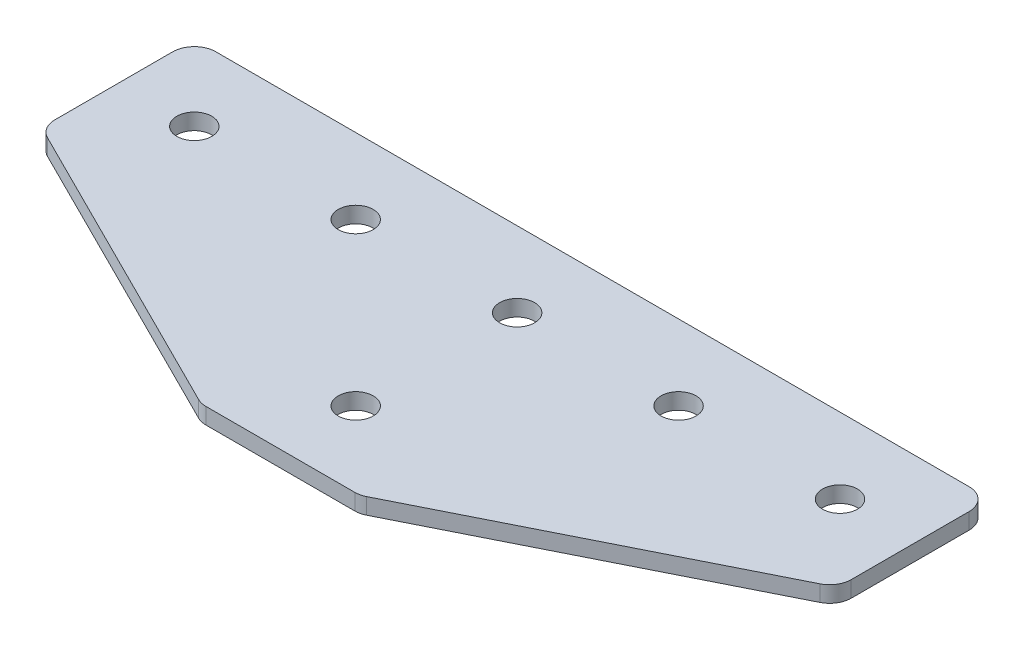
ISO-10303-21;
HEADER;
FILE_DESCRIPTION(('STEP AP214'),'2;1');
FILE_NAME('part.step','',(''),(''),'','','');
FILE_SCHEMA(('AUTOMOTIVE_DESIGN { 1 0 10303 214 1 1 1 1 }'));
ENDSEC;
DATA;
#1=APPLICATION_CONTEXT('core data for automotive mechanical design processes');
#2=APPLICATION_PROTOCOL_DEFINITION('international standard','automotive_design',2000,#1);
#3=PRODUCT_CONTEXT('',#1,'mechanical');
#4=PRODUCT('Part','Part','',(#3));
#5=PRODUCT_RELATED_PRODUCT_CATEGORY('part','',(#4));
#6=PRODUCT_DEFINITION_FORMATION('','',#4);
#7=PRODUCT_DEFINITION_CONTEXT('part definition',#1,'design');
#8=PRODUCT_DEFINITION('design','',#6,#7);
#9=PRODUCT_DEFINITION_SHAPE('','',#8);
#10=(LENGTH_UNIT() NAMED_UNIT(*) SI_UNIT(.MILLI.,.METRE.));
#11=(NAMED_UNIT(*) PLANE_ANGLE_UNIT() SI_UNIT($,.RADIAN.));
#12=(NAMED_UNIT(*) SI_UNIT($,.STERADIAN.) SOLID_ANGLE_UNIT());
#13=UNCERTAINTY_MEASURE_WITH_UNIT(LENGTH_MEASURE(1.E-05),#10,'distance_accuracy_value','');
#14=(GEOMETRIC_REPRESENTATION_CONTEXT(3) GLOBAL_UNCERTAINTY_ASSIGNED_CONTEXT((#13)) GLOBAL_UNIT_ASSIGNED_CONTEXT((#10,
#11,#12)) REPRESENTATION_CONTEXT('',''));
#15=CARTESIAN_POINT('',(0.,0.,0.));
#16=DIRECTION('',(0.,0.,1.));
#17=DIRECTION('',(1.,0.,0.));
#18=AXIS2_PLACEMENT_3D('',#15,#16,#17);
#19=CARTESIAN_POINT('',(-0.890698618547958,1.95798729366106,-9.31684858716831));
#20=DIRECTION('',(0.,-1.,0.));
#21=DIRECTION('',(0.,0.,-1.));
#22=AXIS2_PLACEMENT_3D('',#19,#20,#21);
#23=PLANE('',#22);
#24=CARTESIAN_POINT('',(-0.890698618547958,1.95798729366106,-9.31684858716831));
#25=DIRECTION('',(0.,1.,0.));
#26=DIRECTION('',(0.,0.,1.));
#27=AXIS2_PLACEMENT_3D('',#24,#25,#26);
#28=CIRCLE('',#27,1.625);
#29=CARTESIAN_POINT('',(-0.890698618547958,1.95798729366106,-7.69184858716831));
#30=VERTEX_POINT('',#29);
#31=EDGE_CURVE('E159',#30,#30,#28,.T.);
#32=ORIENTED_EDGE('',*,*,#31,.T.);
#33=EDGE_LOOP('',(#32));
#34=FACE_BOUND('',#33,.T.);
#35=DIRECTION('',(1.,0.,0.));
#36=VECTOR('',#35,1.);
#37=CARTESIAN_POINT('',(-7.89069861854805,1.95798729366106,12.6831514128317));
#38=LINE('',#37,#36);
#39=CARTESIAN_POINT('',(-7.80052867479859,1.95798729366106,12.6831514128317));
#40=VERTEX_POINT('',#39);
#41=CARTESIAN_POINT('',(6.01913143770267,1.95798729366106,12.6831514128317));
#42=VERTEX_POINT('',#41);
#43=EDGE_CURVE('E168',#40,#42,#38,.T.);
#44=ORIENTED_EDGE('',*,*,#43,.F.);
#45=CARTESIAN_POINT('',(-7.80052867479859,1.95798729366106,10.6831514128316));
#46=DIRECTION('',(0.,-1.,0.));
#47=DIRECTION('',(0.,0.,-1.));
#48=AXIS2_PLACEMENT_3D('',#45,#46,#47);
#49=CIRCLE('',#48,2.);
#50=CARTESIAN_POINT('',(-8.6949558657985,1.95798729366106,12.4720057948315));
#51=VERTEX_POINT('',#50);
#52=EDGE_CURVE('E212',#40,#51,#49,.T.);
#53=ORIENTED_EDGE('',*,*,#52,.T.);
#54=DIRECTION('',(-0.894427190999916,0.,-0.447213595499958));
#55=VECTOR('',#54,1.);
#56=CARTESIAN_POINT('',(-8.27266462979816,1.95798729366106,12.6831514128317));
#57=LINE('',#56,#55);
#58=CARTESIAN_POINT('',(-36.7851258095478,1.95798729366106,-1.57307917704317));
#59=VERTEX_POINT('',#58);
#60=EDGE_CURVE('E132',#51,#59,#57,.T.);
#61=ORIENTED_EDGE('',*,*,#60,.T.);
#62=CARTESIAN_POINT('',(-35.8906986185479,1.95798729366106,-3.361933559043));
#63=DIRECTION('',(0.,-1.,0.));
#64=DIRECTION('',(0.,0.,-1.));
#65=AXIS2_PLACEMENT_3D('',#62,#63,#64);
#66=CIRCLE('',#65,2.);
#67=CARTESIAN_POINT('',(-37.8906986185479,1.95798729366106,-3.361933559043));
#68=VERTEX_POINT('',#67);
#69=EDGE_CURVE('E186',#59,#68,#66,.T.);
#70=ORIENTED_EDGE('',*,*,#69,.T.);
#71=DIRECTION('',(0.,0.,-1.));
#72=VECTOR('',#71,1.);
#73=CARTESIAN_POINT('',(-37.8906986185479,1.95798729366106,-2.12586558154321));
#74=LINE('',#73,#72);
#75=CARTESIAN_POINT('',(-37.8906986185479,1.95798729366106,-14.3168485871683));
#76=VERTEX_POINT('',#75);
#77=EDGE_CURVE('E125',#68,#76,#74,.T.);
#78=ORIENTED_EDGE('',*,*,#77,.T.);
#79=CARTESIAN_POINT('',(-35.8906986185479,1.95798729366106,-14.3168485871683));
#80=DIRECTION('',(0.,-1.,0.));
#81=DIRECTION('',(0.,0.,-1.));
#82=AXIS2_PLACEMENT_3D('',#79,#80,#81);
#83=CIRCLE('',#82,2.);
#84=CARTESIAN_POINT('',(-35.8906986185479,1.95798729366106,-16.3168485871683));
#85=VERTEX_POINT('',#84);
#86=EDGE_CURVE('E205',#76,#85,#83,.T.);
#87=ORIENTED_EDGE('',*,*,#86,.T.);
#88=DIRECTION('',(-1.,0.,0.));
#89=VECTOR('',#88,1.);
#90=CARTESIAN_POINT('',(36.1093013814519,1.95798729366106,-16.3168485871684));
#91=LINE('',#90,#89);
#92=CARTESIAN_POINT('',(34.1093013814519,1.95798729366106,-16.3168485871684));
#93=VERTEX_POINT('',#92);
#94=EDGE_CURVE('E165',#93,#85,#91,.T.);
#95=ORIENTED_EDGE('',*,*,#94,.F.);
#96=CARTESIAN_POINT('',(34.1093013814519,1.95798729366106,-14.3168485871684));
#97=DIRECTION('',(0.,-1.,0.));
#98=DIRECTION('',(0.,0.,-1.));
#99=AXIS2_PLACEMENT_3D('',#96,#97,#98);
#100=CIRCLE('',#99,2.);
#101=CARTESIAN_POINT('',(36.1093013814519,1.95798729366106,-14.3168485871684));
#102=VERTEX_POINT('',#101);
#103=EDGE_CURVE('E207',#93,#102,#100,.T.);
#104=ORIENTED_EDGE('',*,*,#103,.T.);
#105=DIRECTION('',(0.,0.,-1.));
#106=VECTOR('',#105,1.);
#107=CARTESIAN_POINT('',(36.1093013814519,1.95798729366106,-2.12586558154322));
#108=LINE('',#107,#106);
#109=CARTESIAN_POINT('',(36.1093013814519,1.95798729366106,-3.361933559043));
#110=VERTEX_POINT('',#109);
#111=EDGE_CURVE('E126',#110,#102,#108,.T.);
#112=ORIENTED_EDGE('',*,*,#111,.F.);
#113=CARTESIAN_POINT('',(34.1093013814519,1.95798729366106,-3.36193355904301));
#114=DIRECTION('',(0.,-1.,0.));
#115=DIRECTION('',(0.,0.,-1.));
#116=AXIS2_PLACEMENT_3D('',#113,#114,#115);
#117=CIRCLE('',#116,2.);
#118=CARTESIAN_POINT('',(35.0037285724519,1.95798729366106,-1.57307917704318));
#119=VERTEX_POINT('',#118);
#120=EDGE_CURVE('E31',#110,#119,#117,.T.);
#121=ORIENTED_EDGE('',*,*,#120,.T.);
#122=DIRECTION('',(0.894427190999916,0.,-0.447213595499959));
#123=VECTOR('',#122,1.);
#124=CARTESIAN_POINT('',(6.49126739270224,1.95798729366106,12.6831514128317));
#125=LINE('',#124,#123);
#126=CARTESIAN_POINT('',(6.91355862870259,1.95798729366106,12.4720057948315));
#127=VERTEX_POINT('',#126);
#128=EDGE_CURVE('E172',#127,#119,#125,.T.);
#129=ORIENTED_EDGE('',*,*,#128,.F.);
#130=CARTESIAN_POINT('',(6.01913143770267,1.95798729366106,10.6831514128316));
#131=DIRECTION('',(0.,-1.,0.));
#132=DIRECTION('',(0.,0.,-1.));
#133=AXIS2_PLACEMENT_3D('',#130,#131,#132);
#134=CIRCLE('',#133,2.);
#135=EDGE_CURVE('E210',#127,#42,#134,.T.);
#136=ORIENTED_EDGE('',*,*,#135,.T.);
#137=EDGE_LOOP('',(#44,#53,#61,#70,#78,#87,#95,#104,#112,#121,#129,#136));
#138=FACE_BOUND('',#137,.T.);
#139=CARTESIAN_POINT('',(-0.890698618547969,1.95798729366106,5.68315141283169));
#140=DIRECTION('',(0.,1.,0.));
#141=DIRECTION('',(0.,0.,1.));
#142=AXIS2_PLACEMENT_3D('',#139,#140,#141);
#143=CIRCLE('',#142,1.625);
#144=CARTESIAN_POINT('',(-0.890698618547969,1.95798729366106,7.30815141283169));
#145=VERTEX_POINT('',#144);
#146=EDGE_CURVE('E147',#145,#145,#143,.T.);
#147=ORIENTED_EDGE('',*,*,#146,.T.);
#148=EDGE_LOOP('',(#147));
#149=FACE_BOUND('',#148,.T.);
#150=CARTESIAN_POINT('',(29.109301381452,1.95798729366106,-9.31684858716831));
#151=DIRECTION('',(0.,1.,0.));
#152=DIRECTION('',(0.,0.,1.));
#153=AXIS2_PLACEMENT_3D('',#150,#151,#152);
#154=CIRCLE('',#153,1.625);
#155=CARTESIAN_POINT('',(29.109301381452,1.95798729366106,-7.69184858716831));
#156=VERTEX_POINT('',#155);
#157=EDGE_CURVE('E140',#156,#156,#154,.T.);
#158=ORIENTED_EDGE('',*,*,#157,.T.);
#159=EDGE_LOOP('',(#158));
#160=FACE_BOUND('',#159,.T.);
#161=CARTESIAN_POINT('',(14.109301381452,1.95798729366106,-9.3168485871683));
#162=DIRECTION('',(0.,1.,0.));
#163=DIRECTION('',(0.,0.,1.));
#164=AXIS2_PLACEMENT_3D('',#161,#162,#163);
#165=CIRCLE('',#164,1.625);
#166=CARTESIAN_POINT('',(14.109301381452,1.95798729366106,-7.6918485871683));
#167=VERTEX_POINT('',#166);
#168=EDGE_CURVE('E153',#167,#167,#165,.T.);
#169=ORIENTED_EDGE('',*,*,#168,.T.);
#170=EDGE_LOOP('',(#169));
#171=FACE_BOUND('',#170,.T.);
#172=CARTESIAN_POINT('',(-30.890698618548,1.95798729366106,-9.31684858716831));
#173=DIRECTION('',(0.,-1.,0.));
#174=DIRECTION('',(0.,0.,1.));
#175=AXIS2_PLACEMENT_3D('',#172,#173,#174);
#176=CIRCLE('',#175,1.625);
#177=CARTESIAN_POINT('',(-30.890698618548,1.95798729366106,-7.69184858716831));
#178=VERTEX_POINT('',#177);
#179=EDGE_CURVE('E460',#178,#178,#176,.T.);
#180=ORIENTED_EDGE('',*,*,#179,.F.);
#181=EDGE_LOOP('',(#180));
#182=FACE_BOUND('',#181,.T.);
#183=CARTESIAN_POINT('',(-15.890698618548,1.95798729366106,-9.3168485871683));
#184=DIRECTION('',(0.,-1.,0.));
#185=DIRECTION('',(0.,0.,1.));
#186=AXIS2_PLACEMENT_3D('',#183,#184,#185);
#187=CIRCLE('',#186,1.625);
#188=CARTESIAN_POINT('',(-15.890698618548,1.95798729366106,-7.6918485871683));
#189=VERTEX_POINT('',#188);
#190=EDGE_CURVE('E136',#189,#189,#187,.T.);
#191=ORIENTED_EDGE('',*,*,#190,.F.);
#192=EDGE_LOOP('',(#191));
#193=FACE_BOUND('',#192,.T.);
#194=ADVANCED_FACE('F16',(#34,#138,#149,#160,#171,#182,#193),#23,.T.);
#195=CARTESIAN_POINT('',(36.1093013814519,1.95798729366106,-16.3168485871684));
#196=DIRECTION('',(0.,0.,-1.));
#197=DIRECTION('',(-1.,0.,0.));
#198=AXIS2_PLACEMENT_3D('',#195,#196,#197);
#199=PLANE('',#198);
#200=DIRECTION('',(-1.,0.,0.));
#201=VECTOR('',#200,1.);
#202=CARTESIAN_POINT('',(36.1093013814519,3.45798729366106,-16.3168485871684));
#203=LINE('',#202,#201);
#204=CARTESIAN_POINT('',(34.1093013814519,3.45798729366106,-16.3168485871684));
#205=VERTEX_POINT('',#204);
#206=CARTESIAN_POINT('',(-35.8906986185479,3.45798729366106,-16.3168485871683));
#207=VERTEX_POINT('',#206);
#208=EDGE_CURVE('E162',#205,#207,#203,.T.);
#209=ORIENTED_EDGE('',*,*,#208,.F.);
#210=DIRECTION('',(0.,1.,0.));
#211=VECTOR('',#210,1.);
#212=CARTESIAN_POINT('',(34.1093013814519,1.95798729366106,-16.3168485871684));
#213=LINE('',#212,#211);
#214=EDGE_CURVE('E24',#205,#93,#213,.F.);
#215=ORIENTED_EDGE('',*,*,#214,.T.);
#216=ORIENTED_EDGE('',*,*,#94,.T.);
#217=DIRECTION('',(0.,1.,0.));
#218=VECTOR('',#217,1.);
#219=CARTESIAN_POINT('',(-35.8906986185479,1.95798729366106,-16.3168485871683));
#220=LINE('',#219,#218);
#221=EDGE_CURVE('E223',#85,#207,#220,.T.);
#222=ORIENTED_EDGE('',*,*,#221,.T.);
#223=EDGE_LOOP('',(#209,#215,#216,#222));
#224=FACE_BOUND('',#223,.T.);
#225=ADVANCED_FACE('F229',(#224),#199,.T.);
#226=CARTESIAN_POINT('',(36.1093013814519,1.95798729366106,-2.12586558154322));
#227=DIRECTION('',(1.,0.,0.));
#228=DIRECTION('',(0.,0.,-1.));
#229=AXIS2_PLACEMENT_3D('',#226,#227,#228);
#230=PLANE('',#229);
#231=DIRECTION('',(0.,0.,-1.));
#232=VECTOR('',#231,1.);
#233=CARTESIAN_POINT('',(36.1093013814519,3.45798729366106,-2.12586558154322));
#234=LINE('',#233,#232);
#235=CARTESIAN_POINT('',(36.1093013814519,3.45798729366106,-3.361933559043));
#236=VERTEX_POINT('',#235);
#237=CARTESIAN_POINT('',(36.1093013814519,3.45798729366106,-14.3168485871684));
#238=VERTEX_POINT('',#237);
#239=EDGE_CURVE('E169',#236,#238,#234,.T.);
#240=ORIENTED_EDGE('',*,*,#239,.F.);
#241=DIRECTION('',(0.,1.,0.));
#242=VECTOR('',#241,1.);
#243=CARTESIAN_POINT('',(36.1093013814519,1.95798729366106,-3.361933559043));
#244=LINE('',#243,#242);
#245=EDGE_CURVE('E221',#236,#110,#244,.F.);
#246=ORIENTED_EDGE('',*,*,#245,.T.);
#247=ORIENTED_EDGE('',*,*,#111,.T.);
#248=DIRECTION('',(0.,1.,0.));
#249=VECTOR('',#248,1.);
#250=CARTESIAN_POINT('',(36.1093013814519,1.95798729366106,-14.3168485871684));
#251=LINE('',#250,#249);
#252=EDGE_CURVE('E218',#102,#238,#251,.T.);
#253=ORIENTED_EDGE('',*,*,#252,.T.);
#254=EDGE_LOOP('',(#240,#246,#247,#253));
#255=FACE_BOUND('',#254,.T.);
#256=ADVANCED_FACE('F240',(#255),#230,.T.);
#257=CARTESIAN_POINT('',(6.49126739270224,1.95798729366106,12.6831514128317));
#258=DIRECTION('',(0.447213595499958,0.,0.894427190999916));
#259=DIRECTION('',(0.894427190999916,0.,-0.447213595499959));
#260=AXIS2_PLACEMENT_3D('',#257,#258,#259);
#261=PLANE('',#260);
#262=DIRECTION('',(0.894427190999916,0.,-0.447213595499959));
#263=VECTOR('',#262,1.);
#264=CARTESIAN_POINT('',(6.49126739270224,3.45798729366106,12.6831514128317));
#265=LINE('',#264,#263);
#266=CARTESIAN_POINT('',(6.91355862870259,3.45798729366106,12.4720057948315));
#267=VERTEX_POINT('',#266);
#268=CARTESIAN_POINT('',(35.0037285724519,3.45798729366106,-1.57307917704318));
#269=VERTEX_POINT('',#268);
#270=EDGE_CURVE('E180',#267,#269,#265,.T.);
#271=ORIENTED_EDGE('',*,*,#270,.F.);
#272=DIRECTION('',(0.,1.,0.));
#273=VECTOR('',#272,1.);
#274=CARTESIAN_POINT('',(6.91355862870259,1.95798729366106,12.4720057948315));
#275=LINE('',#274,#273);
#276=EDGE_CURVE('E38',#267,#127,#275,.F.);
#277=ORIENTED_EDGE('',*,*,#276,.T.);
#278=ORIENTED_EDGE('',*,*,#128,.T.);
#279=DIRECTION('',(0.,1.,0.));
#280=VECTOR('',#279,1.);
#281=CARTESIAN_POINT('',(35.0037285724518,1.95798729366106,-1.57307917704317));
#282=LINE('',#281,#280);
#283=EDGE_CURVE('E214',#119,#269,#282,.T.);
#284=ORIENTED_EDGE('',*,*,#283,.T.);
#285=EDGE_LOOP('',(#271,#277,#278,#284));
#286=FACE_BOUND('',#285,.T.);
#287=ADVANCED_FACE('F245',(#286),#261,.T.);
#288=CARTESIAN_POINT('',(-7.89069861854805,1.95798729366106,12.6831514128317));
#289=DIRECTION('',(0.,0.,1.));
#290=DIRECTION('',(1.,0.,0.));
#291=AXIS2_PLACEMENT_3D('',#288,#289,#290);
#292=PLANE('',#291);
#293=DIRECTION('',(1.,0.,0.));
#294=VECTOR('',#293,1.);
#295=CARTESIAN_POINT('',(-7.89069861854805,3.45798729366106,12.6831514128317));
#296=LINE('',#295,#294);
#297=CARTESIAN_POINT('',(-7.80052867479859,3.45798729366106,12.6831514128317));
#298=VERTEX_POINT('',#297);
#299=CARTESIAN_POINT('',(6.01913143770267,3.45798729366106,12.6831514128317));
#300=VERTEX_POINT('',#299);
#301=EDGE_CURVE('E177',#298,#300,#296,.T.);
#302=ORIENTED_EDGE('',*,*,#301,.F.);
#303=DIRECTION('',(0.,1.,0.));
#304=VECTOR('',#303,1.);
#305=CARTESIAN_POINT('',(-7.80052867479859,1.95798729366106,12.6831514128317));
#306=LINE('',#305,#304);
#307=EDGE_CURVE('E203',#298,#40,#306,.F.);
#308=ORIENTED_EDGE('',*,*,#307,.T.);
#309=ORIENTED_EDGE('',*,*,#43,.T.);
#310=DIRECTION('',(0.,1.,0.));
#311=VECTOR('',#310,1.);
#312=CARTESIAN_POINT('',(6.01913143770267,1.95798729366106,12.6831514128317));
#313=LINE('',#312,#311);
#314=EDGE_CURVE('E200',#42,#300,#313,.T.);
#315=ORIENTED_EDGE('',*,*,#314,.T.);
#316=EDGE_LOOP('',(#302,#308,#309,#315));
#317=FACE_BOUND('',#316,.T.);
#318=ADVANCED_FACE('F252',(#317),#292,.T.);
#319=CARTESIAN_POINT('',(-0.890698618547958,3.45798729366106,-9.31684858716831));
#320=DIRECTION('',(0.,-1.,0.));
#321=DIRECTION('',(0.,0.,-1.));
#322=AXIS2_PLACEMENT_3D('',#319,#320,#321);
#323=PLANE('',#322);
#324=CARTESIAN_POINT('',(-0.890698618547958,3.45798729366106,-9.31684858716831));
#325=DIRECTION('',(0.,1.,0.));
#326=DIRECTION('',(0.,0.,1.));
#327=AXIS2_PLACEMENT_3D('',#324,#325,#326);
#328=CIRCLE('',#327,1.625);
#329=CARTESIAN_POINT('',(-0.890698618547958,3.45798729366106,-7.69184858716831));
#330=VERTEX_POINT('',#329);
#331=EDGE_CURVE('E156',#330,#330,#328,.T.);
#332=ORIENTED_EDGE('',*,*,#331,.F.);
#333=EDGE_LOOP('',(#332));
#334=FACE_BOUND('',#333,.T.);
#335=DIRECTION('',(-0.894427190999916,0.,-0.447213595499958));
#336=VECTOR('',#335,1.);
#337=CARTESIAN_POINT('',(-8.27266462979816,3.45798729366106,12.6831514128317));
#338=LINE('',#337,#336);
#339=CARTESIAN_POINT('',(-8.6949558657985,3.45798729366106,12.4720057948315));
#340=VERTEX_POINT('',#339);
#341=CARTESIAN_POINT('',(-36.7851258095478,3.45798729366106,-1.57307917704317));
#342=VERTEX_POINT('',#341);
#343=EDGE_CURVE('E133',#340,#342,#338,.T.);
#344=ORIENTED_EDGE('',*,*,#343,.F.);
#345=CARTESIAN_POINT('',(-7.80052867479859,3.45798729366106,10.6831514128316));
#346=DIRECTION('',(0.,-1.,0.));
#347=DIRECTION('',(0.,0.,-1.));
#348=AXIS2_PLACEMENT_3D('',#345,#346,#347);
#349=CIRCLE('',#348,2.);
#350=EDGE_CURVE('E198',#340,#298,#349,.F.);
#351=ORIENTED_EDGE('',*,*,#350,.T.);
#352=ORIENTED_EDGE('',*,*,#301,.T.);
#353=CARTESIAN_POINT('',(6.01913143770267,3.45798729366106,10.6831514128316));
#354=DIRECTION('',(0.,-1.,0.));
#355=DIRECTION('',(0.,0.,-1.));
#356=AXIS2_PLACEMENT_3D('',#353,#354,#355);
#357=CIRCLE('',#356,2.);
#358=EDGE_CURVE('E196',#300,#267,#357,.F.);
#359=ORIENTED_EDGE('',*,*,#358,.T.);
#360=ORIENTED_EDGE('',*,*,#270,.T.);
#361=CARTESIAN_POINT('',(34.1093013814519,3.45798729366106,-3.36193355904301));
#362=DIRECTION('',(0.,-1.,0.));
#363=DIRECTION('',(0.,0.,-1.));
#364=AXIS2_PLACEMENT_3D('',#361,#362,#363);
#365=CIRCLE('',#364,2.);
#366=EDGE_CURVE('E194',#269,#236,#365,.F.);
#367=ORIENTED_EDGE('',*,*,#366,.T.);
#368=ORIENTED_EDGE('',*,*,#239,.T.);
#369=CARTESIAN_POINT('',(34.1093013814519,3.45798729366106,-14.3168485871684));
#370=DIRECTION('',(0.,-1.,0.));
#371=DIRECTION('',(0.,0.,-1.));
#372=AXIS2_PLACEMENT_3D('',#369,#370,#371);
#373=CIRCLE('',#372,2.);
#374=EDGE_CURVE('E192',#238,#205,#373,.F.);
#375=ORIENTED_EDGE('',*,*,#374,.T.);
#376=ORIENTED_EDGE('',*,*,#208,.T.);
#377=CARTESIAN_POINT('',(-35.8906986185479,3.45798729366106,-14.3168485871683));
#378=DIRECTION('',(0.,-1.,0.));
#379=DIRECTION('',(0.,0.,-1.));
#380=AXIS2_PLACEMENT_3D('',#377,#378,#379);
#381=CIRCLE('',#380,2.);
#382=CARTESIAN_POINT('',(-37.8906986185479,3.45798729366106,-14.3168485871683));
#383=VERTEX_POINT('',#382);
#384=EDGE_CURVE('E131',#207,#383,#381,.F.);
#385=ORIENTED_EDGE('',*,*,#384,.T.);
#386=DIRECTION('',(0.,0.,-1.));
#387=VECTOR('',#386,1.);
#388=CARTESIAN_POINT('',(-37.8906986185479,3.45798729366106,-2.12586558154321));
#389=LINE('',#388,#387);
#390=CARTESIAN_POINT('',(-37.8906986185479,3.45798729366106,-3.361933559043));
#391=VERTEX_POINT('',#390);
#392=EDGE_CURVE('E122',#391,#383,#389,.T.);
#393=ORIENTED_EDGE('',*,*,#392,.F.);
#394=CARTESIAN_POINT('',(-35.8906986185479,3.45798729366106,-3.361933559043));
#395=DIRECTION('',(0.,-1.,0.));
#396=DIRECTION('',(0.,0.,-1.));
#397=AXIS2_PLACEMENT_3D('',#394,#395,#396);
#398=CIRCLE('',#397,2.);
#399=EDGE_CURVE('E107',#391,#342,#398,.F.);
#400=ORIENTED_EDGE('',*,*,#399,.T.);
#401=EDGE_LOOP('',(#344,#351,#352,#359,#360,#367,#368,#375,#376,#385,#393,#400));
#402=FACE_BOUND('',#401,.T.);
#403=CARTESIAN_POINT('',(29.109301381452,3.45798729366106,-9.31684858716831));
#404=DIRECTION('',(0.,1.,0.));
#405=DIRECTION('',(0.,0.,1.));
#406=AXIS2_PLACEMENT_3D('',#403,#404,#405);
#407=CIRCLE('',#406,1.625);
#408=CARTESIAN_POINT('',(29.109301381452,3.45798729366106,-7.69184858716831));
#409=VERTEX_POINT('',#408);
#410=EDGE_CURVE('E144',#409,#409,#407,.T.);
#411=ORIENTED_EDGE('',*,*,#410,.F.);
#412=EDGE_LOOP('',(#411));
#413=FACE_BOUND('',#412,.T.);
#414=CARTESIAN_POINT('',(14.109301381452,3.45798729366106,-9.3168485871683));
#415=DIRECTION('',(0.,1.,0.));
#416=DIRECTION('',(0.,0.,1.));
#417=AXIS2_PLACEMENT_3D('',#414,#415,#416);
#418=CIRCLE('',#417,1.625);
#419=CARTESIAN_POINT('',(14.109301381452,3.45798729366106,-7.6918485871683));
#420=VERTEX_POINT('',#419);
#421=EDGE_CURVE('E150',#420,#420,#418,.T.);
#422=ORIENTED_EDGE('',*,*,#421,.F.);
#423=EDGE_LOOP('',(#422));
#424=FACE_BOUND('',#423,.T.);
#425=CARTESIAN_POINT('',(-0.890698618547969,3.45798729366106,5.68315141283169));
#426=DIRECTION('',(0.,1.,0.));
#427=DIRECTION('',(0.,0.,1.));
#428=AXIS2_PLACEMENT_3D('',#425,#426,#427);
#429=CIRCLE('',#428,1.625);
#430=CARTESIAN_POINT('',(-0.890698618547969,3.45798729366106,7.30815141283169));
#431=VERTEX_POINT('',#430);
#432=EDGE_CURVE('E143',#431,#431,#429,.T.);
#433=ORIENTED_EDGE('',*,*,#432,.F.);
#434=EDGE_LOOP('',(#433));
#435=FACE_BOUND('',#434,.T.);
#436=CARTESIAN_POINT('',(-30.890698618548,3.45798729366106,-9.31684858716831));
#437=DIRECTION('',(0.,-1.,0.));
#438=DIRECTION('',(0.,0.,1.));
#439=AXIS2_PLACEMENT_3D('',#436,#437,#438);
#440=CIRCLE('',#439,1.625);
#441=CARTESIAN_POINT('',(-30.890698618548,3.45798729366106,-7.69184858716831));
#442=VERTEX_POINT('',#441);
#443=EDGE_CURVE('E455',#442,#442,#440,.T.);
#444=ORIENTED_EDGE('',*,*,#443,.T.);
#445=EDGE_LOOP('',(#444));
#446=FACE_BOUND('',#445,.T.);
#447=CARTESIAN_POINT('',(-15.890698618548,3.45798729366106,-9.3168485871683));
#448=DIRECTION('',(0.,-1.,0.));
#449=DIRECTION('',(0.,0.,1.));
#450=AXIS2_PLACEMENT_3D('',#447,#448,#449);
#451=CIRCLE('',#450,1.625);
#452=CARTESIAN_POINT('',(-15.890698618548,3.45798729366106,-7.6918485871683));
#453=VERTEX_POINT('',#452);
#454=EDGE_CURVE('E458',#453,#453,#451,.T.);
#455=ORIENTED_EDGE('',*,*,#454,.T.);
#456=EDGE_LOOP('',(#455));
#457=FACE_BOUND('',#456,.T.);
#458=ADVANCED_FACE('F128',(#334,#402,#413,#424,#435,#446,#457),#323,.F.);
#459=CARTESIAN_POINT('',(-0.890698618547958,1.95798729366106,-9.31684858716831));
#460=DIRECTION('',(0.,1.,0.));
#461=DIRECTION('',(0.,0.,1.));
#462=AXIS2_PLACEMENT_3D('',#459,#460,#461);
#463=CYLINDRICAL_SURFACE('',#462,1.625);
#464=ORIENTED_EDGE('',*,*,#31,.F.);
#465=EDGE_LOOP('',(#464));
#466=FACE_BOUND('',#465,.T.);
#467=ORIENTED_EDGE('',*,*,#331,.T.);
#468=EDGE_LOOP('',(#467));
#469=FACE_BOUND('',#468,.T.);
#470=ADVANCED_FACE('F379',(#466,#469),#463,.F.);
#471=CARTESIAN_POINT('',(14.109301381452,1.95798729366106,-9.3168485871683));
#472=DIRECTION('',(0.,1.,0.));
#473=DIRECTION('',(0.,0.,1.));
#474=AXIS2_PLACEMENT_3D('',#471,#472,#473);
#475=CYLINDRICAL_SURFACE('',#474,1.625);
#476=ORIENTED_EDGE('',*,*,#168,.F.);
#477=EDGE_LOOP('',(#476));
#478=FACE_BOUND('',#477,.T.);
#479=ORIENTED_EDGE('',*,*,#421,.T.);
#480=EDGE_LOOP('',(#479));
#481=FACE_BOUND('',#480,.T.);
#482=ADVANCED_FACE('F370',(#478,#481),#475,.F.);
#483=CARTESIAN_POINT('',(-0.890698618547969,1.95798729366106,5.68315141283169));
#484=DIRECTION('',(0.,1.,0.));
#485=DIRECTION('',(0.,0.,1.));
#486=AXIS2_PLACEMENT_3D('',#483,#484,#485);
#487=CYLINDRICAL_SURFACE('',#486,1.625);
#488=ORIENTED_EDGE('',*,*,#432,.T.);
#489=EDGE_LOOP('',(#488));
#490=FACE_BOUND('',#489,.T.);
#491=ORIENTED_EDGE('',*,*,#146,.F.);
#492=EDGE_LOOP('',(#491));
#493=FACE_BOUND('',#492,.T.);
#494=ADVANCED_FACE('F361',(#490,#493),#487,.F.);
#495=CARTESIAN_POINT('',(29.109301381452,1.95798729366106,-9.31684858716831));
#496=DIRECTION('',(0.,1.,0.));
#497=DIRECTION('',(0.,0.,1.));
#498=AXIS2_PLACEMENT_3D('',#495,#496,#497);
#499=CYLINDRICAL_SURFACE('',#498,1.625);
#500=ORIENTED_EDGE('',*,*,#157,.F.);
#501=EDGE_LOOP('',(#500));
#502=FACE_BOUND('',#501,.T.);
#503=ORIENTED_EDGE('',*,*,#410,.T.);
#504=EDGE_LOOP('',(#503));
#505=FACE_BOUND('',#504,.T.);
#506=ADVANCED_FACE('F353',(#502,#505),#499,.F.);
#507=CARTESIAN_POINT('',(-37.8906986185479,1.95798729366106,-2.12586558154321));
#508=DIRECTION('',(-1.,0.,0.));
#509=DIRECTION('',(0.,0.,-1.));
#510=AXIS2_PLACEMENT_3D('',#507,#508,#509);
#511=PLANE('',#510);
#512=ORIENTED_EDGE('',*,*,#392,.T.);
#513=DIRECTION('',(0.,1.,0.));
#514=VECTOR('',#513,1.);
#515=CARTESIAN_POINT('',(-37.8906986185479,1.95798729366106,-14.3168485871683));
#516=LINE('',#515,#514);
#517=EDGE_CURVE('E10',#383,#76,#516,.F.);
#518=ORIENTED_EDGE('',*,*,#517,.T.);
#519=ORIENTED_EDGE('',*,*,#77,.F.);
#520=DIRECTION('',(0.,1.,0.));
#521=VECTOR('',#520,1.);
#522=CARTESIAN_POINT('',(-37.8906986185479,1.95798729366106,-3.361933559043));
#523=LINE('',#522,#521);
#524=EDGE_CURVE('E111',#68,#391,#523,.T.);
#525=ORIENTED_EDGE('',*,*,#524,.T.);
#526=EDGE_LOOP('',(#512,#518,#519,#525));
#527=FACE_BOUND('',#526,.T.);
#528=ADVANCED_FACE('F121',(#527),#511,.T.);
#529=CARTESIAN_POINT('',(-8.27266462979816,1.95798729366106,12.6831514128317));
#530=DIRECTION('',(-0.447213595499958,0.,0.894427190999916));
#531=DIRECTION('',(-0.894427190999916,0.,-0.447213595499958));
#532=AXIS2_PLACEMENT_3D('',#529,#530,#531);
#533=PLANE('',#532);
#534=ORIENTED_EDGE('',*,*,#60,.F.);
#535=DIRECTION('',(0.,1.,0.));
#536=VECTOR('',#535,1.);
#537=CARTESIAN_POINT('',(-8.6949558657985,1.95798729366106,12.4720057948315));
#538=LINE('',#537,#536);
#539=EDGE_CURVE('E188',#51,#340,#538,.T.);
#540=ORIENTED_EDGE('',*,*,#539,.T.);
#541=ORIENTED_EDGE('',*,*,#343,.T.);
#542=DIRECTION('',(0.,1.,0.));
#543=VECTOR('',#542,1.);
#544=CARTESIAN_POINT('',(-36.7851258095478,1.95798729366106,-1.57307917704316));
#545=LINE('',#544,#543);
#546=EDGE_CURVE('E113',#342,#59,#545,.F.);
#547=ORIENTED_EDGE('',*,*,#546,.T.);
#548=EDGE_LOOP('',(#534,#540,#541,#547));
#549=FACE_BOUND('',#548,.T.);
#550=ADVANCED_FACE('F260',(#549),#533,.T.);
#551=CARTESIAN_POINT('',(-15.890698618548,1.95798729366106,-9.3168485871683));
#552=DIRECTION('',(0.,1.,0.));
#553=DIRECTION('',(0.,0.,1.));
#554=AXIS2_PLACEMENT_3D('',#551,#552,#553);
#555=CYLINDRICAL_SURFACE('',#554,1.625);
#556=ORIENTED_EDGE('',*,*,#190,.T.);
#557=EDGE_LOOP('',(#556));
#558=FACE_BOUND('',#557,.T.);
#559=ORIENTED_EDGE('',*,*,#454,.F.);
#560=EDGE_LOOP('',(#559));
#561=FACE_BOUND('',#560,.T.);
#562=ADVANCED_FACE('F329',(#558,#561),#555,.F.);
#563=CARTESIAN_POINT('',(-30.890698618548,1.95798729366106,-9.31684858716831));
#564=DIRECTION('',(0.,1.,0.));
#565=DIRECTION('',(0.,0.,1.));
#566=AXIS2_PLACEMENT_3D('',#563,#564,#565);
#567=CYLINDRICAL_SURFACE('',#566,1.625);
#568=ORIENTED_EDGE('',*,*,#179,.T.);
#569=EDGE_LOOP('',(#568));
#570=FACE_BOUND('',#569,.T.);
#571=ORIENTED_EDGE('',*,*,#443,.F.);
#572=EDGE_LOOP('',(#571));
#573=FACE_BOUND('',#572,.T.);
#574=ADVANCED_FACE('F278',(#570,#573),#567,.F.);
#575=CARTESIAN_POINT('',(-35.8906986185479,1.95798729366106,-3.361933559043));
#576=DIRECTION('',(0.,1.,0.));
#577=DIRECTION('',(0.,0.,1.));
#578=AXIS2_PLACEMENT_3D('',#575,#576,#577);
#579=CYLINDRICAL_SURFACE('',#578,2.);
#580=ORIENTED_EDGE('',*,*,#69,.F.);
#581=ORIENTED_EDGE('',*,*,#546,.F.);
#582=ORIENTED_EDGE('',*,*,#399,.F.);
#583=ORIENTED_EDGE('',*,*,#524,.F.);
#584=EDGE_LOOP('',(#580,#581,#582,#583));
#585=FACE_BOUND('',#584,.T.);
#586=ADVANCED_FACE('F110',(#585),#579,.T.);
#587=CARTESIAN_POINT('',(-7.80052867479859,1.95798729366106,10.6831514128316));
#588=DIRECTION('',(0.,1.,0.));
#589=DIRECTION('',(0.,0.,1.));
#590=AXIS2_PLACEMENT_3D('',#587,#588,#589);
#591=CYLINDRICAL_SURFACE('',#590,2.);
#592=ORIENTED_EDGE('',*,*,#52,.F.);
#593=ORIENTED_EDGE('',*,*,#307,.F.);
#594=ORIENTED_EDGE('',*,*,#350,.F.);
#595=ORIENTED_EDGE('',*,*,#539,.F.);
#596=EDGE_LOOP('',(#592,#593,#594,#595));
#597=FACE_BOUND('',#596,.T.);
#598=ADVANCED_FACE('F257',(#597),#591,.T.);
#599=CARTESIAN_POINT('',(6.01913143770267,1.95798729366106,10.6831514128316));
#600=DIRECTION('',(0.,1.,0.));
#601=DIRECTION('',(0.,0.,1.));
#602=AXIS2_PLACEMENT_3D('',#599,#600,#601);
#603=CYLINDRICAL_SURFACE('',#602,2.);
#604=ORIENTED_EDGE('',*,*,#135,.F.);
#605=ORIENTED_EDGE('',*,*,#276,.F.);
#606=ORIENTED_EDGE('',*,*,#358,.F.);
#607=ORIENTED_EDGE('',*,*,#314,.F.);
#608=EDGE_LOOP('',(#604,#605,#606,#607));
#609=FACE_BOUND('',#608,.T.);
#610=ADVANCED_FACE('F249',(#609),#603,.T.);
#611=CARTESIAN_POINT('',(34.1093013814519,1.95798729366106,-3.36193355904301));
#612=DIRECTION('',(0.,1.,0.));
#613=DIRECTION('',(0.,0.,1.));
#614=AXIS2_PLACEMENT_3D('',#611,#612,#613);
#615=CYLINDRICAL_SURFACE('',#614,2.);
#616=ORIENTED_EDGE('',*,*,#120,.F.);
#617=ORIENTED_EDGE('',*,*,#245,.F.);
#618=ORIENTED_EDGE('',*,*,#366,.F.);
#619=ORIENTED_EDGE('',*,*,#283,.F.);
#620=EDGE_LOOP('',(#616,#617,#618,#619));
#621=FACE_BOUND('',#620,.T.);
#622=ADVANCED_FACE('F244',(#621),#615,.T.);
#623=CARTESIAN_POINT('',(34.1093013814519,1.95798729366106,-14.3168485871684));
#624=DIRECTION('',(0.,1.,0.));
#625=DIRECTION('',(0.,0.,1.));
#626=AXIS2_PLACEMENT_3D('',#623,#624,#625);
#627=CYLINDRICAL_SURFACE('',#626,2.);
#628=ORIENTED_EDGE('',*,*,#103,.F.);
#629=ORIENTED_EDGE('',*,*,#214,.F.);
#630=ORIENTED_EDGE('',*,*,#374,.F.);
#631=ORIENTED_EDGE('',*,*,#252,.F.);
#632=EDGE_LOOP('',(#628,#629,#630,#631));
#633=FACE_BOUND('',#632,.T.);
#634=ADVANCED_FACE('F237',(#633),#627,.T.);
#635=CARTESIAN_POINT('',(-35.8906986185479,1.95798729366106,-14.3168485871683));
#636=DIRECTION('',(0.,1.,0.));
#637=DIRECTION('',(0.,0.,1.));
#638=AXIS2_PLACEMENT_3D('',#635,#636,#637);
#639=CYLINDRICAL_SURFACE('',#638,2.);
#640=ORIENTED_EDGE('',*,*,#86,.F.);
#641=ORIENTED_EDGE('',*,*,#517,.F.);
#642=ORIENTED_EDGE('',*,*,#384,.F.);
#643=ORIENTED_EDGE('',*,*,#221,.F.);
#644=EDGE_LOOP('',(#640,#641,#642,#643));
#645=FACE_BOUND('',#644,.T.);
#646=ADVANCED_FACE('F18',(#645),#639,.T.);
#647=CLOSED_SHELL('',(#194,#225,#256,#287,#318,#458,#470,#482,#494,#506,#528,#550,#562,#574,
#586,#598,#610,#622,#634,#646));
#648=MANIFOLD_SOLID_BREP('B1',#647);
#649=ADVANCED_BREP_SHAPE_REPRESENTATION('',(#18,#648),#14);
#650=SHAPE_DEFINITION_REPRESENTATION(#9,#649);
ENDSEC;
END-ISO-10303-21;
